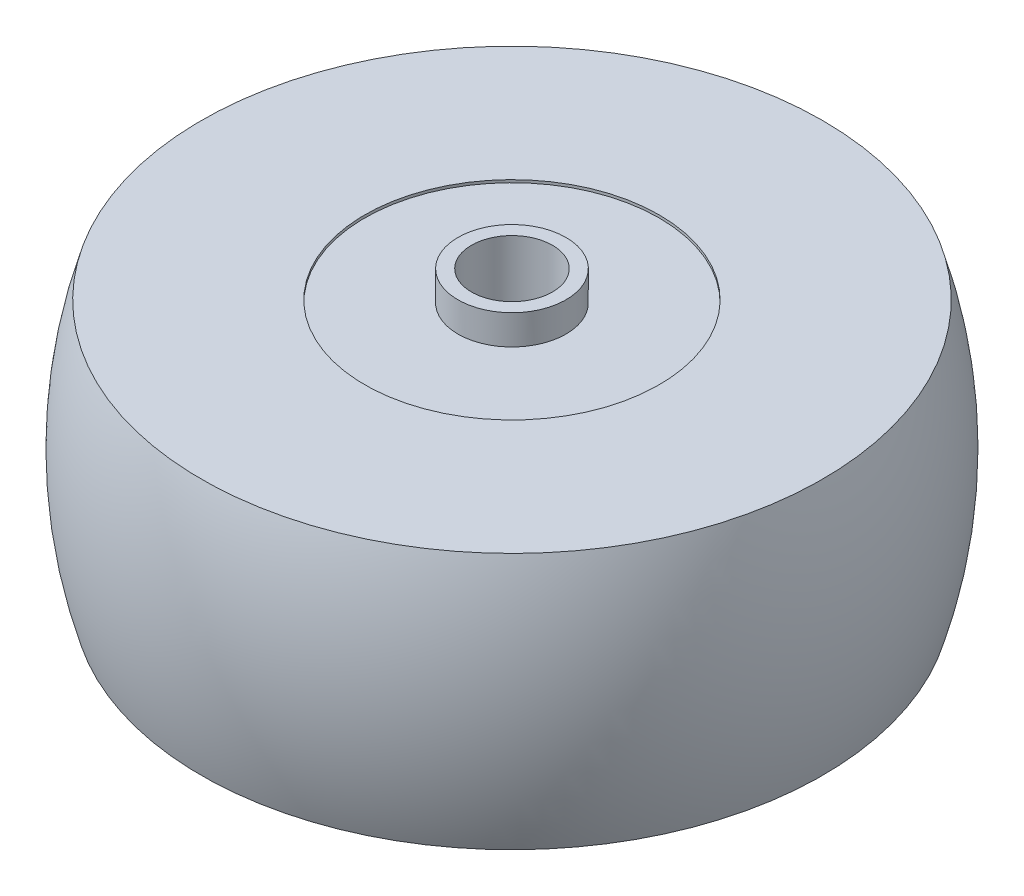
ISO-10303-21;
HEADER;
FILE_DESCRIPTION(('STEP AP214'),'2;1');
FILE_NAME('part.step','',(''),(''),'','','');
FILE_SCHEMA(('AUTOMOTIVE_DESIGN { 1 0 10303 214 1 1 1 1 }'));
ENDSEC;
DATA;
#1=APPLICATION_CONTEXT('core data for automotive mechanical design processes');
#2=APPLICATION_PROTOCOL_DEFINITION('international standard','automotive_design',2000,#1);
#3=PRODUCT_CONTEXT('',#1,'mechanical');
#4=PRODUCT('Part','Part','',(#3));
#5=PRODUCT_RELATED_PRODUCT_CATEGORY('part','',(#4));
#6=PRODUCT_DEFINITION_FORMATION('','',#4);
#7=PRODUCT_DEFINITION_CONTEXT('part definition',#1,'design');
#8=PRODUCT_DEFINITION('design','',#6,#7);
#9=PRODUCT_DEFINITION_SHAPE('','',#8);
#10=(LENGTH_UNIT() NAMED_UNIT(*) SI_UNIT(.MILLI.,.METRE.));
#11=(NAMED_UNIT(*) PLANE_ANGLE_UNIT() SI_UNIT($,.RADIAN.));
#12=(NAMED_UNIT(*) SI_UNIT($,.STERADIAN.) SOLID_ANGLE_UNIT());
#13=UNCERTAINTY_MEASURE_WITH_UNIT(LENGTH_MEASURE(1.E-05),#10,'distance_accuracy_value','');
#14=(GEOMETRIC_REPRESENTATION_CONTEXT(3) GLOBAL_UNCERTAINTY_ASSIGNED_CONTEXT((#13)) GLOBAL_UNIT_ASSIGNED_CONTEXT((#10,
#11,#12)) REPRESENTATION_CONTEXT('',''));
#15=CARTESIAN_POINT('',(0.,0.,0.));
#16=DIRECTION('',(0.,0.,1.));
#17=DIRECTION('',(1.,0.,0.));
#18=AXIS2_PLACEMENT_3D('',#15,#16,#17);
#19=CARTESIAN_POINT('',(0.,-9.3,-3.));
#20=DIRECTION('',(0.,-1.,0.));
#21=DIRECTION('',(0.,0.,-1.));
#22=AXIS2_PLACEMENT_3D('',#19,#20,#21);
#23=PLANE('',#22);
#24=CARTESIAN_POINT('',(0.,-9.3,0.));
#25=DIRECTION('',(0.,-1.,0.));
#26=DIRECTION('',(0.,0.,-1.));
#27=AXIS2_PLACEMENT_3D('',#24,#25,#26);
#28=CIRCLE('',#27,4.);
#29=CARTESIAN_POINT('',(0.,-9.3,-4.));
#30=VERTEX_POINT('',#29);
#31=EDGE_CURVE('E10',#30,#30,#28,.T.);
#32=ORIENTED_EDGE('',*,*,#31,.F.);
#33=EDGE_LOOP('',(#32));
#34=FACE_BOUND('',#33,.T.);
#35=CARTESIAN_POINT('',(0.,-9.3,0.));
#36=DIRECTION('',(0.,-1.,0.));
#37=DIRECTION('',(0.,0.,-1.));
#38=AXIS2_PLACEMENT_3D('',#35,#36,#37);
#39=CIRCLE('',#38,10.9);
#40=CARTESIAN_POINT('',(0.,-9.3,-10.9));
#41=VERTEX_POINT('',#40);
#42=EDGE_CURVE('E65',#41,#41,#39,.T.);
#43=ORIENTED_EDGE('',*,*,#42,.T.);
#44=EDGE_LOOP('',(#43));
#45=FACE_BOUND('',#44,.T.);
#46=ADVANCED_FACE('F37',(#34,#45),#23,.T.);
#47=CARTESIAN_POINT('',(0.,0.,0.));
#48=DIRECTION('',(0.,-1.,0.));
#49=DIRECTION('',(0.,0.,-1.));
#50=AXIS2_PLACEMENT_3D('',#47,#48,#49);
#51=CYLINDRICAL_SURFACE('',#50,3.);
#52=CARTESIAN_POINT('',(0.,11.5,0.));
#53=DIRECTION('',(0.,-1.,0.));
#54=DIRECTION('',(0.,0.,-1.));
#55=AXIS2_PLACEMENT_3D('',#52,#53,#54);
#56=CIRCLE('',#55,3.);
#57=CARTESIAN_POINT('',(0.,11.5,-3.));
#58=VERTEX_POINT('',#57);
#59=EDGE_CURVE('E68',#58,#58,#56,.T.);
#60=ORIENTED_EDGE('',*,*,#59,.F.);
#61=EDGE_LOOP('',(#60));
#62=FACE_BOUND('',#61,.T.);
#63=CARTESIAN_POINT('',(0.,-11.5,0.));
#64=DIRECTION('',(0.,-1.,0.));
#65=DIRECTION('',(0.,0.,-1.));
#66=AXIS2_PLACEMENT_3D('',#63,#64,#65);
#67=CIRCLE('',#66,3.);
#68=CARTESIAN_POINT('',(0.,-11.5,-3.));
#69=VERTEX_POINT('',#68);
#70=EDGE_CURVE('E74',#69,#69,#67,.T.);
#71=ORIENTED_EDGE('',*,*,#70,.T.);
#72=EDGE_LOOP('',(#71));
#73=FACE_BOUND('',#72,.T.);
#74=ADVANCED_FACE('F93',(#62,#73),#51,.F.);
#75=CARTESIAN_POINT('',(0.,9.3,-3.));
#76=DIRECTION('',(0.,1.,0.));
#77=DIRECTION('',(0.,0.,1.));
#78=AXIS2_PLACEMENT_3D('',#75,#76,#77);
#79=PLANE('',#78);
#80=CARTESIAN_POINT('',(0.,9.3,0.));
#81=DIRECTION('',(0.,1.,0.));
#82=DIRECTION('',(0.,0.,1.));
#83=AXIS2_PLACEMENT_3D('',#80,#81,#82);
#84=CIRCLE('',#83,4.);
#85=CARTESIAN_POINT('',(0.,9.3,4.));
#86=VERTEX_POINT('',#85);
#87=EDGE_CURVE('E43',#86,#86,#84,.T.);
#88=ORIENTED_EDGE('',*,*,#87,.F.);
#89=EDGE_LOOP('',(#88));
#90=FACE_BOUND('',#89,.T.);
#91=CARTESIAN_POINT('',(0.,9.3,0.));
#92=DIRECTION('',(0.,-1.,0.));
#93=DIRECTION('',(0.,0.,-1.));
#94=AXIS2_PLACEMENT_3D('',#91,#92,#93);
#95=CIRCLE('',#94,10.9);
#96=CARTESIAN_POINT('',(0.,9.3,-10.9));
#97=VERTEX_POINT('',#96);
#98=EDGE_CURVE('E47',#97,#97,#95,.T.);
#99=ORIENTED_EDGE('',*,*,#98,.F.);
#100=EDGE_LOOP('',(#99));
#101=FACE_BOUND('',#100,.T.);
#102=ADVANCED_FACE('F99',(#90,#101),#79,.T.);
#103=CARTESIAN_POINT('',(0.,0.,0.));
#104=DIRECTION('',(0.,-1.,0.));
#105=DIRECTION('',(0.,0.,-1.));
#106=AXIS2_PLACEMENT_3D('',#103,#104,#105);
#107=CYLINDRICAL_SURFACE('',#106,10.9);
#108=ORIENTED_EDGE('',*,*,#98,.T.);
#109=EDGE_LOOP('',(#108));
#110=FACE_BOUND('',#109,.T.);
#111=CARTESIAN_POINT('',(0.,9.5,0.));
#112=DIRECTION('',(0.,-1.,0.));
#113=DIRECTION('',(0.,0.,-1.));
#114=AXIS2_PLACEMENT_3D('',#111,#112,#113);
#115=CIRCLE('',#114,10.9);
#116=CARTESIAN_POINT('',(0.,9.5,-10.9));
#117=VERTEX_POINT('',#116);
#118=EDGE_CURVE('E51',#117,#117,#115,.T.);
#119=ORIENTED_EDGE('',*,*,#118,.F.);
#120=EDGE_LOOP('',(#119));
#121=FACE_BOUND('',#120,.T.);
#122=ADVANCED_FACE('F126',(#110,#121),#107,.F.);
#123=CARTESIAN_POINT('',(0.,9.5,-10.9));
#124=DIRECTION('',(0.,1.,0.));
#125=DIRECTION('',(0.,0.,1.));
#126=AXIS2_PLACEMENT_3D('',#123,#124,#125);
#127=PLANE('',#126);
#128=ORIENTED_EDGE('',*,*,#118,.T.);
#129=EDGE_LOOP('',(#128));
#130=FACE_BOUND('',#129,.T.);
#131=CARTESIAN_POINT('',(0.,9.5,0.));
#132=DIRECTION('',(0.,-1.,0.));
#133=DIRECTION('',(0.,0.,-1.));
#134=AXIS2_PLACEMENT_3D('',#131,#132,#133);
#135=CIRCLE('',#134,23.);
#136=CARTESIAN_POINT('',(0.,9.5,-23.));
#137=VERTEX_POINT('',#136);
#138=EDGE_CURVE('E56',#137,#137,#135,.T.);
#139=ORIENTED_EDGE('',*,*,#138,.F.);
#140=EDGE_LOOP('',(#139));
#141=FACE_BOUND('',#140,.T.);
#142=ADVANCED_FACE('F122',(#130,#141),#127,.T.);
#143=CARTESIAN_POINT('',(0.,0.,0.));
#144=DIRECTION('',(0.,-1.,0.));
#145=DIRECTION('',(0.,0.,-1.));
#146=AXIS2_PLACEMENT_3D('',#143,#144,#145);
#147=DEGENERATE_TOROIDAL_SURFACE('',#146,8.53214285714297,32.932142857143,.F.);
#148=ORIENTED_EDGE('',*,*,#138,.T.);
#149=EDGE_LOOP('',(#148));
#150=FACE_BOUND('',#149,.T.);
#151=CARTESIAN_POINT('',(0.,-9.49999999999999,0.));
#152=DIRECTION('',(0.,-1.,0.));
#153=DIRECTION('',(0.,0.,-1.));
#154=AXIS2_PLACEMENT_3D('',#151,#152,#153);
#155=CIRCLE('',#154,23.);
#156=CARTESIAN_POINT('',(0.,-9.49999999999999,-23.));
#157=VERTEX_POINT('',#156);
#158=EDGE_CURVE('E59',#157,#157,#155,.T.);
#159=ORIENTED_EDGE('',*,*,#158,.F.);
#160=EDGE_LOOP('',(#159));
#161=FACE_BOUND('',#160,.T.);
#162=ADVANCED_FACE('F115',(#150,#161),#147,.F.);
#163=CARTESIAN_POINT('',(0.,-9.49999999999999,-23.));
#164=DIRECTION('',(0.,-1.,0.));
#165=DIRECTION('',(0.,0.,-1.));
#166=AXIS2_PLACEMENT_3D('',#163,#164,#165);
#167=PLANE('',#166);
#168=ORIENTED_EDGE('',*,*,#158,.T.);
#169=EDGE_LOOP('',(#168));
#170=FACE_BOUND('',#169,.T.);
#171=CARTESIAN_POINT('',(0.,-9.5,0.));
#172=DIRECTION('',(0.,-1.,0.));
#173=DIRECTION('',(0.,0.,-1.));
#174=AXIS2_PLACEMENT_3D('',#171,#172,#173);
#175=CIRCLE('',#174,10.9);
#176=CARTESIAN_POINT('',(0.,-9.5,-10.9));
#177=VERTEX_POINT('',#176);
#178=EDGE_CURVE('E62',#177,#177,#175,.T.);
#179=ORIENTED_EDGE('',*,*,#178,.F.);
#180=EDGE_LOOP('',(#179));
#181=FACE_BOUND('',#180,.T.);
#182=ADVANCED_FACE('F106',(#170,#181),#167,.T.);
#183=CARTESIAN_POINT('',(0.,0.,0.));
#184=DIRECTION('',(0.,-1.,0.));
#185=DIRECTION('',(0.,0.,-1.));
#186=AXIS2_PLACEMENT_3D('',#183,#184,#185);
#187=CYLINDRICAL_SURFACE('',#186,10.9);
#188=ORIENTED_EDGE('',*,*,#178,.T.);
#189=EDGE_LOOP('',(#188));
#190=FACE_BOUND('',#189,.T.);
#191=ORIENTED_EDGE('',*,*,#42,.F.);
#192=EDGE_LOOP('',(#191));
#193=FACE_BOUND('',#192,.T.);
#194=ADVANCED_FACE('F104',(#190,#193),#187,.F.);
#195=CARTESIAN_POINT('',(3.,11.5,0.));
#196=DIRECTION('',(0.,1.,0.));
#197=DIRECTION('',(0.,0.,1.));
#198=AXIS2_PLACEMENT_3D('',#195,#196,#197);
#199=PLANE('',#198);
#200=ORIENTED_EDGE('',*,*,#59,.T.);
#201=EDGE_LOOP('',(#200));
#202=FACE_BOUND('',#201,.T.);
#203=CARTESIAN_POINT('',(0.,11.5,0.));
#204=DIRECTION('',(0.,-1.,0.));
#205=DIRECTION('',(0.,0.,-1.));
#206=AXIS2_PLACEMENT_3D('',#203,#204,#205);
#207=CIRCLE('',#206,4.);
#208=CARTESIAN_POINT('',(0.,11.5,-4.));
#209=VERTEX_POINT('',#208);
#210=EDGE_CURVE('E71',#209,#209,#207,.T.);
#211=ORIENTED_EDGE('',*,*,#210,.F.);
#212=EDGE_LOOP('',(#211));
#213=FACE_BOUND('',#212,.T.);
#214=ADVANCED_FACE('F105',(#202,#213),#199,.T.);
#215=CARTESIAN_POINT('',(0.,0.,0.));
#216=DIRECTION('',(0.,-1.,0.));
#217=DIRECTION('',(0.,0.,-1.));
#218=AXIS2_PLACEMENT_3D('',#215,#216,#217);
#219=CYLINDRICAL_SURFACE('',#218,4.);
#220=ORIENTED_EDGE('',*,*,#210,.T.);
#221=EDGE_LOOP('',(#220));
#222=FACE_BOUND('',#221,.T.);
#223=ORIENTED_EDGE('',*,*,#87,.T.);
#224=EDGE_LOOP('',(#223));
#225=FACE_BOUND('',#224,.T.);
#226=ADVANCED_FACE('F90',(#222,#225),#219,.T.);
#227=CARTESIAN_POINT('',(3.,-11.5,0.));
#228=DIRECTION('',(0.,-1.,0.));
#229=DIRECTION('',(0.,0.,-1.));
#230=AXIS2_PLACEMENT_3D('',#227,#228,#229);
#231=PLANE('',#230);
#232=CARTESIAN_POINT('',(0.,-11.5,0.));
#233=DIRECTION('',(0.,-1.,0.));
#234=DIRECTION('',(0.,0.,-1.));
#235=AXIS2_PLACEMENT_3D('',#232,#233,#234);
#236=CIRCLE('',#235,4.);
#237=CARTESIAN_POINT('',(0.,-11.5,-4.));
#238=VERTEX_POINT('',#237);
#239=EDGE_CURVE('E77',#238,#238,#236,.T.);
#240=ORIENTED_EDGE('',*,*,#239,.T.);
#241=EDGE_LOOP('',(#240));
#242=FACE_BOUND('',#241,.T.);
#243=ORIENTED_EDGE('',*,*,#70,.F.);
#244=EDGE_LOOP('',(#243));
#245=FACE_BOUND('',#244,.T.);
#246=ADVANCED_FACE('F81',(#242,#245),#231,.T.);
#247=CARTESIAN_POINT('',(0.,0.,0.));
#248=DIRECTION('',(0.,-1.,0.));
#249=DIRECTION('',(0.,0.,-1.));
#250=AXIS2_PLACEMENT_3D('',#247,#248,#249);
#251=CYLINDRICAL_SURFACE('',#250,4.);
#252=ORIENTED_EDGE('',*,*,#31,.T.);
#253=EDGE_LOOP('',(#252));
#254=FACE_BOUND('',#253,.T.);
#255=ORIENTED_EDGE('',*,*,#239,.F.);
#256=EDGE_LOOP('',(#255));
#257=FACE_BOUND('',#256,.T.);
#258=ADVANCED_FACE('F84',(#254,#257),#251,.T.);
#259=CLOSED_SHELL('',(#46,#74,#102,#122,#142,#162,#182,#194,#214,#226,#246,#258));
#260=MANIFOLD_SOLID_BREP('B2',#259);
#261=ADVANCED_BREP_SHAPE_REPRESENTATION('',(#18,#260),#14);
#262=SHAPE_DEFINITION_REPRESENTATION(#9,#261);
ENDSEC;
END-ISO-10303-21;
